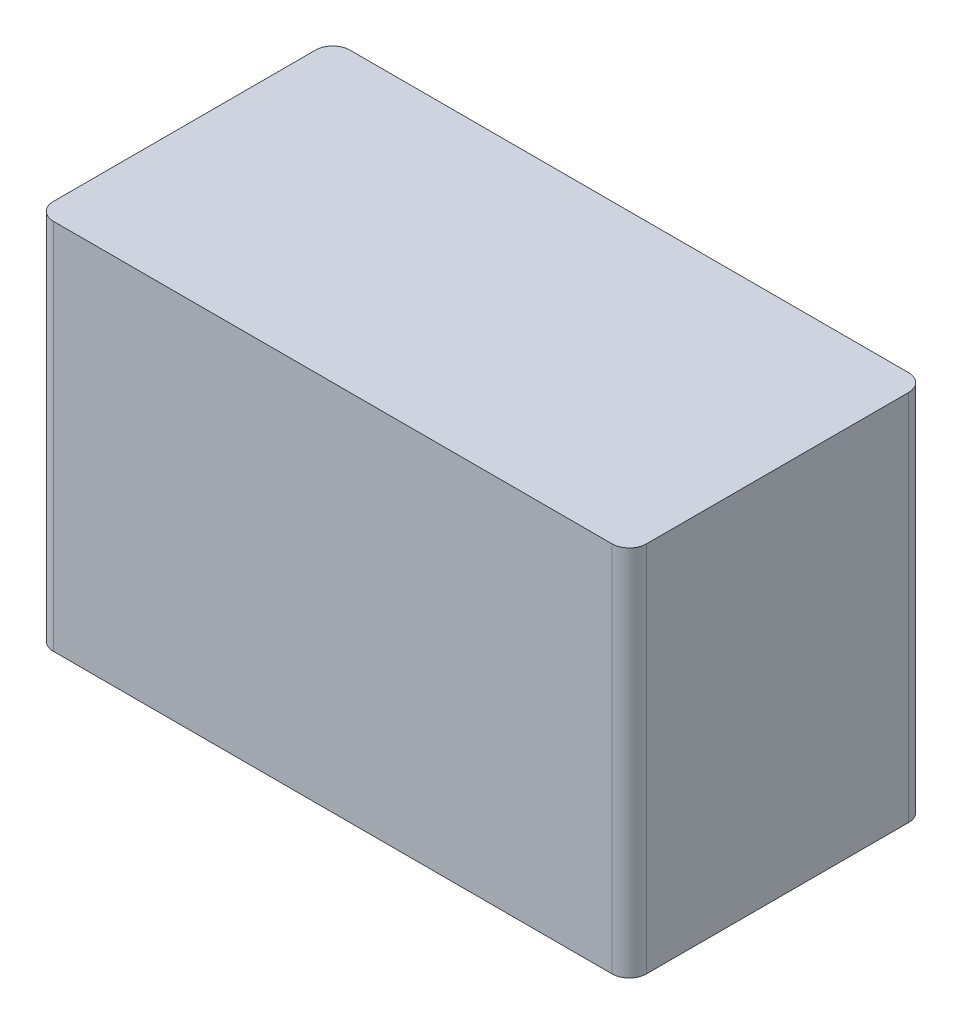
ISO-10303-21;
HEADER;
FILE_DESCRIPTION(('STEP AP214'),'2;1');
FILE_NAME('part.step','',(''),(''),'','','');
FILE_SCHEMA(('AUTOMOTIVE_DESIGN { 1 0 10303 214 1 1 1 1 }'));
ENDSEC;
DATA;
#1=APPLICATION_CONTEXT('core data for automotive mechanical design processes');
#2=APPLICATION_PROTOCOL_DEFINITION('international standard','automotive_design',2000,#1);
#3=PRODUCT_CONTEXT('',#1,'mechanical');
#4=PRODUCT('Part','Part','',(#3));
#5=PRODUCT_RELATED_PRODUCT_CATEGORY('part','',(#4));
#6=PRODUCT_DEFINITION_FORMATION('','',#4);
#7=PRODUCT_DEFINITION_CONTEXT('part definition',#1,'design');
#8=PRODUCT_DEFINITION('design','',#6,#7);
#9=PRODUCT_DEFINITION_SHAPE('','',#8);
#10=(LENGTH_UNIT() NAMED_UNIT(*) SI_UNIT(.MILLI.,.METRE.));
#11=(NAMED_UNIT(*) PLANE_ANGLE_UNIT() SI_UNIT($,.RADIAN.));
#12=(NAMED_UNIT(*) SI_UNIT($,.STERADIAN.) SOLID_ANGLE_UNIT());
#13=UNCERTAINTY_MEASURE_WITH_UNIT(LENGTH_MEASURE(1.E-05),#10,'distance_accuracy_value','');
#14=(GEOMETRIC_REPRESENTATION_CONTEXT(3) GLOBAL_UNCERTAINTY_ASSIGNED_CONTEXT((#13)) GLOBAL_UNIT_ASSIGNED_CONTEXT((#10,
#11,#12)) REPRESENTATION_CONTEXT('',''));
#15=CARTESIAN_POINT('',(0.,0.,0.));
#16=DIRECTION('',(0.,0.,1.));
#17=DIRECTION('',(1.,0.,0.));
#18=AXIS2_PLACEMENT_3D('',#15,#16,#17);
#19=CARTESIAN_POINT('',(20.7,26.,10.35));
#20=DIRECTION('',(-1.,0.,0.));
#21=DIRECTION('',(0.,0.,1.));
#22=AXIS2_PLACEMENT_3D('',#19,#20,#21);
#23=PLANE('',#22);
#24=DIRECTION('',(0.,0.,-1.));
#25=VECTOR('',#24,1.);
#26=CARTESIAN_POINT('',(20.7,0.,10.35));
#27=LINE('',#26,#25);
#28=CARTESIAN_POINT('',(20.7,0.,9.15));
#29=VERTEX_POINT('',#28);
#30=CARTESIAN_POINT('',(20.7,0.,-9.15));
#31=VERTEX_POINT('',#30);
#32=EDGE_CURVE('E126',#29,#31,#27,.T.);
#33=ORIENTED_EDGE('',*,*,#32,.T.);
#34=DIRECTION('',(0.,-1.,0.));
#35=VECTOR('',#34,1.);
#36=CARTESIAN_POINT('',(20.7,26.,-9.15));
#37=LINE('',#36,#35);
#38=CARTESIAN_POINT('',(20.7,26.,-9.15));
#39=VERTEX_POINT('',#38);
#40=EDGE_CURVE('E104',#31,#39,#37,.F.);
#41=ORIENTED_EDGE('',*,*,#40,.T.);
#42=DIRECTION('',(0.,0.,-1.));
#43=VECTOR('',#42,1.);
#44=CARTESIAN_POINT('',(20.7,26.,10.35));
#45=LINE('',#44,#43);
#46=CARTESIAN_POINT('',(20.7,26.,9.15));
#47=VERTEX_POINT('',#46);
#48=EDGE_CURVE('E136',#47,#39,#45,.T.);
#49=ORIENTED_EDGE('',*,*,#48,.F.);
#50=DIRECTION('',(0.,-1.,0.));
#51=VECTOR('',#50,1.);
#52=CARTESIAN_POINT('',(20.7,26.,9.15));
#53=LINE('',#52,#51);
#54=EDGE_CURVE('E109',#47,#29,#53,.T.);
#55=ORIENTED_EDGE('',*,*,#54,.T.);
#56=EDGE_LOOP('',(#33,#41,#49,#55));
#57=FACE_BOUND('',#56,.T.);
#58=ADVANCED_FACE('F34',(#57),#23,.F.);
#59=CARTESIAN_POINT('',(-20.7,26.,-10.35));
#60=DIRECTION('',(0.,0.,1.));
#61=DIRECTION('',(1.,0.,0.));
#62=AXIS2_PLACEMENT_3D('',#59,#60,#61);
#63=PLANE('',#62);
#64=DIRECTION('',(-1.,0.,0.));
#65=VECTOR('',#64,1.);
#66=CARTESIAN_POINT('',(-20.7,26.,-10.35));
#67=LINE('',#66,#65);
#68=CARTESIAN_POINT('',(19.5,26.,-10.35));
#69=VERTEX_POINT('',#68);
#70=CARTESIAN_POINT('',(-19.5,26.,-10.35));
#71=VERTEX_POINT('',#70);
#72=EDGE_CURVE('E119',#69,#71,#67,.T.);
#73=ORIENTED_EDGE('',*,*,#72,.F.);
#74=DIRECTION('',(0.,-1.,0.));
#75=VECTOR('',#74,1.);
#76=CARTESIAN_POINT('',(19.5,26.,-10.35));
#77=LINE('',#76,#75);
#78=CARTESIAN_POINT('',(19.5,0.,-10.35));
#79=VERTEX_POINT('',#78);
#80=EDGE_CURVE('E103',#69,#79,#77,.T.);
#81=ORIENTED_EDGE('',*,*,#80,.T.);
#82=DIRECTION('',(-1.,0.,0.));
#83=VECTOR('',#82,1.);
#84=CARTESIAN_POINT('',(-20.7,0.,-10.35));
#85=LINE('',#84,#83);
#86=CARTESIAN_POINT('',(-19.5,0.,-10.35));
#87=VERTEX_POINT('',#86);
#88=EDGE_CURVE('E116',#79,#87,#85,.T.);
#89=ORIENTED_EDGE('',*,*,#88,.T.);
#90=DIRECTION('',(0.,-1.,0.));
#91=VECTOR('',#90,1.);
#92=CARTESIAN_POINT('',(-19.5,26.,-10.35));
#93=LINE('',#92,#91);
#94=EDGE_CURVE('E121',#87,#71,#93,.F.);
#95=ORIENTED_EDGE('',*,*,#94,.T.);
#96=EDGE_LOOP('',(#73,#81,#89,#95));
#97=FACE_BOUND('',#96,.T.);
#98=ADVANCED_FACE('F115',(#97),#63,.F.);
#99=CARTESIAN_POINT('',(-20.7,26.,10.35));
#100=DIRECTION('',(1.,0.,0.));
#101=DIRECTION('',(0.,0.,-1.));
#102=AXIS2_PLACEMENT_3D('',#99,#100,#101);
#103=PLANE('',#102);
#104=CARTESIAN_POINT('',(-20.7,10.,0.));
#105=DIRECTION('',(1.,0.,0.));
#106=DIRECTION('',(0.,0.,-1.));
#107=AXIS2_PLACEMENT_3D('',#104,#105,#106);
#108=CIRCLE('',#107,5.65);
#109=CARTESIAN_POINT('',(-20.7,10.,-5.65));
#110=VERTEX_POINT('',#109);
#111=EDGE_CURVE('E144',#110,#110,#108,.T.);
#112=ORIENTED_EDGE('',*,*,#111,.T.);
#113=EDGE_LOOP('',(#112));
#114=FACE_BOUND('',#113,.T.);
#115=DIRECTION('',(0.,0.,1.));
#116=VECTOR('',#115,1.);
#117=CARTESIAN_POINT('',(-20.7,26.,10.35));
#118=LINE('',#117,#116);
#119=CARTESIAN_POINT('',(-20.7,26.,-9.15));
#120=VERTEX_POINT('',#119);
#121=CARTESIAN_POINT('',(-20.7,26.,9.15));
#122=VERTEX_POINT('',#121);
#123=EDGE_CURVE('E182',#120,#122,#118,.T.);
#124=ORIENTED_EDGE('',*,*,#123,.F.);
#125=DIRECTION('',(0.,-1.,0.));
#126=VECTOR('',#125,1.);
#127=CARTESIAN_POINT('',(-20.7,26.,-9.15));
#128=LINE('',#127,#126);
#129=CARTESIAN_POINT('',(-20.7,0.,-9.15));
#130=VERTEX_POINT('',#129);
#131=EDGE_CURVE('E167',#120,#130,#128,.T.);
#132=ORIENTED_EDGE('',*,*,#131,.T.);
#133=DIRECTION('',(0.,0.,1.));
#134=VECTOR('',#133,1.);
#135=CARTESIAN_POINT('',(-20.7,0.,10.35));
#136=LINE('',#135,#134);
#137=CARTESIAN_POINT('',(-20.7,0.,9.15));
#138=VERTEX_POINT('',#137);
#139=EDGE_CURVE('E125',#130,#138,#136,.T.);
#140=ORIENTED_EDGE('',*,*,#139,.T.);
#141=DIRECTION('',(0.,-1.,0.));
#142=VECTOR('',#141,1.);
#143=CARTESIAN_POINT('',(-20.7,26.,9.15));
#144=LINE('',#143,#142);
#145=EDGE_CURVE('E165',#138,#122,#144,.F.);
#146=ORIENTED_EDGE('',*,*,#145,.T.);
#147=EDGE_LOOP('',(#124,#132,#140,#146));
#148=FACE_BOUND('',#147,.T.);
#149=ADVANCED_FACE('F197',(#114,#148),#103,.F.);
#150=CARTESIAN_POINT('',(-20.7,26.,10.35));
#151=DIRECTION('',(0.,0.,-1.));
#152=DIRECTION('',(-1.,0.,0.));
#153=AXIS2_PLACEMENT_3D('',#150,#151,#152);
#154=PLANE('',#153);
#155=DIRECTION('',(1.,0.,0.));
#156=VECTOR('',#155,1.);
#157=CARTESIAN_POINT('',(-20.7,0.,10.35));
#158=LINE('',#157,#156);
#159=CARTESIAN_POINT('',(-19.5,0.,10.35));
#160=VERTEX_POINT('',#159);
#161=CARTESIAN_POINT('',(19.5,0.,10.35));
#162=VERTEX_POINT('',#161);
#163=EDGE_CURVE('E129',#160,#162,#158,.T.);
#164=ORIENTED_EDGE('',*,*,#163,.T.);
#165=DIRECTION('',(0.,-1.,0.));
#166=VECTOR('',#165,1.);
#167=CARTESIAN_POINT('',(19.5,26.,10.35));
#168=LINE('',#167,#166);
#169=CARTESIAN_POINT('',(19.5,26.,10.35));
#170=VERTEX_POINT('',#169);
#171=EDGE_CURVE('E11',#162,#170,#168,.F.);
#172=ORIENTED_EDGE('',*,*,#171,.T.);
#173=DIRECTION('',(1.,0.,0.));
#174=VECTOR('',#173,1.);
#175=CARTESIAN_POINT('',(-20.7,26.,10.35));
#176=LINE('',#175,#174);
#177=CARTESIAN_POINT('',(-19.5,26.,10.35));
#178=VERTEX_POINT('',#177);
#179=EDGE_CURVE('E141',#178,#170,#176,.T.);
#180=ORIENTED_EDGE('',*,*,#179,.F.);
#181=DIRECTION('',(0.,-1.,0.));
#182=VECTOR('',#181,1.);
#183=CARTESIAN_POINT('',(-19.5,26.,10.35));
#184=LINE('',#183,#182);
#185=EDGE_CURVE('E42',#178,#160,#184,.T.);
#186=ORIENTED_EDGE('',*,*,#185,.T.);
#187=EDGE_LOOP('',(#164,#172,#180,#186));
#188=FACE_BOUND('',#187,.T.);
#189=ADVANCED_FACE('F172',(#188),#154,.F.);
#190=CARTESIAN_POINT('',(0.,26.,0.));
#191=DIRECTION('',(0.,-1.,0.));
#192=DIRECTION('',(0.,0.,-1.));
#193=AXIS2_PLACEMENT_3D('',#190,#191,#192);
#194=PLANE('',#193);
#195=ORIENTED_EDGE('',*,*,#48,.T.);
#196=CARTESIAN_POINT('',(19.5,26.,-9.15));
#197=DIRECTION('',(0.,-1.,0.));
#198=DIRECTION('',(0.,0.,-1.));
#199=AXIS2_PLACEMENT_3D('',#196,#197,#198);
#200=CIRCLE('',#199,1.2);
#201=EDGE_CURVE('E163',#39,#69,#200,.F.);
#202=ORIENTED_EDGE('',*,*,#201,.T.);
#203=ORIENTED_EDGE('',*,*,#72,.T.);
#204=CARTESIAN_POINT('',(-19.5,26.,-9.15));
#205=DIRECTION('',(0.,-1.,0.));
#206=DIRECTION('',(0.,0.,-1.));
#207=AXIS2_PLACEMENT_3D('',#204,#205,#206);
#208=CIRCLE('',#207,1.2);
#209=EDGE_CURVE('E161',#71,#120,#208,.F.);
#210=ORIENTED_EDGE('',*,*,#209,.T.);
#211=ORIENTED_EDGE('',*,*,#123,.T.);
#212=CARTESIAN_POINT('',(-19.5,26.,9.15));
#213=DIRECTION('',(0.,-1.,0.));
#214=DIRECTION('',(0.,0.,-1.));
#215=AXIS2_PLACEMENT_3D('',#212,#213,#214);
#216=CIRCLE('',#215,1.2);
#217=EDGE_CURVE('E54',#122,#178,#216,.F.);
#218=ORIENTED_EDGE('',*,*,#217,.T.);
#219=ORIENTED_EDGE('',*,*,#179,.T.);
#220=CARTESIAN_POINT('',(19.5,26.,9.15));
#221=DIRECTION('',(0.,-1.,0.));
#222=DIRECTION('',(0.,0.,-1.));
#223=AXIS2_PLACEMENT_3D('',#220,#221,#222);
#224=CIRCLE('',#223,1.2);
#225=EDGE_CURVE('E159',#170,#47,#224,.F.);
#226=ORIENTED_EDGE('',*,*,#225,.T.);
#227=EDGE_LOOP('',(#195,#202,#203,#210,#211,#218,#219,#226));
#228=FACE_BOUND('',#227,.T.);
#229=ADVANCED_FACE('F188',(#228),#194,.F.);
#230=CARTESIAN_POINT('',(0.,0.,0.));
#231=DIRECTION('',(0.,-1.,0.));
#232=DIRECTION('',(0.,0.,-1.));
#233=AXIS2_PLACEMENT_3D('',#230,#231,#232);
#234=PLANE('',#233);
#235=ORIENTED_EDGE('',*,*,#88,.F.);
#236=CARTESIAN_POINT('',(19.5,0.,-9.15));
#237=DIRECTION('',(0.,-1.,0.));
#238=DIRECTION('',(0.,0.,-1.));
#239=AXIS2_PLACEMENT_3D('',#236,#237,#238);
#240=CIRCLE('',#239,1.2);
#241=EDGE_CURVE('E99',#79,#31,#240,.T.);
#242=ORIENTED_EDGE('',*,*,#241,.T.);
#243=ORIENTED_EDGE('',*,*,#32,.F.);
#244=CARTESIAN_POINT('',(19.5,0.,9.15));
#245=DIRECTION('',(0.,-1.,0.));
#246=DIRECTION('',(0.,0.,-1.));
#247=AXIS2_PLACEMENT_3D('',#244,#245,#246);
#248=CIRCLE('',#247,1.2);
#249=EDGE_CURVE('E152',#29,#162,#248,.T.);
#250=ORIENTED_EDGE('',*,*,#249,.T.);
#251=ORIENTED_EDGE('',*,*,#163,.F.);
#252=CARTESIAN_POINT('',(-19.5,0.,9.15));
#253=DIRECTION('',(0.,-1.,0.));
#254=DIRECTION('',(0.,0.,-1.));
#255=AXIS2_PLACEMENT_3D('',#252,#253,#254);
#256=CIRCLE('',#255,1.2);
#257=EDGE_CURVE('E120',#160,#138,#256,.T.);
#258=ORIENTED_EDGE('',*,*,#257,.T.);
#259=ORIENTED_EDGE('',*,*,#139,.F.);
#260=CARTESIAN_POINT('',(-19.5,0.,-9.15));
#261=DIRECTION('',(0.,-1.,0.));
#262=DIRECTION('',(0.,0.,-1.));
#263=AXIS2_PLACEMENT_3D('',#260,#261,#262);
#264=CIRCLE('',#263,1.2);
#265=EDGE_CURVE('E110',#130,#87,#264,.T.);
#266=ORIENTED_EDGE('',*,*,#265,.T.);
#267=EDGE_LOOP('',(#235,#242,#243,#250,#251,#258,#259,#266));
#268=FACE_BOUND('',#267,.T.);
#269=ADVANCED_FACE('F123',(#268),#234,.T.);
#270=CARTESIAN_POINT('',(-21.7,10.,0.));
#271=DIRECTION('',(1.,0.,0.));
#272=DIRECTION('',(0.,0.,-1.));
#273=AXIS2_PLACEMENT_3D('',#270,#271,#272);
#274=CYLINDRICAL_SURFACE('',#273,5.25);
#275=CARTESIAN_POINT('',(-21.1,10.,0.));
#276=DIRECTION('',(1.,0.,0.));
#277=DIRECTION('',(0.,0.,-1.));
#278=AXIS2_PLACEMENT_3D('',#275,#276,#277);
#279=CIRCLE('',#278,5.25);
#280=CARTESIAN_POINT('',(-21.1,10.,-5.25));
#281=VERTEX_POINT('',#280);
#282=EDGE_CURVE('E140',#281,#281,#279,.F.);
#283=ORIENTED_EDGE('',*,*,#282,.T.);
#284=EDGE_LOOP('',(#283));
#285=FACE_BOUND('',#284,.T.);
#286=CARTESIAN_POINT('',(-21.3,10.,0.));
#287=DIRECTION('',(-1.,0.,0.));
#288=DIRECTION('',(0.,0.,1.));
#289=AXIS2_PLACEMENT_3D('',#286,#287,#288);
#290=CIRCLE('',#289,5.25);
#291=CARTESIAN_POINT('',(-21.3,10.,5.25));
#292=VERTEX_POINT('',#291);
#293=EDGE_CURVE('E137',#292,#292,#290,.F.);
#294=ORIENTED_EDGE('',*,*,#293,.T.);
#295=EDGE_LOOP('',(#294));
#296=FACE_BOUND('',#295,.T.);
#297=ADVANCED_FACE('F195',(#285,#296),#274,.T.);
#298=CARTESIAN_POINT('',(-21.7,10.,0.));
#299=DIRECTION('',(-1.,0.,0.));
#300=DIRECTION('',(0.,0.,1.));
#301=AXIS2_PLACEMENT_3D('',#298,#299,#300);
#302=PLANE('',#301);
#303=CARTESIAN_POINT('',(-21.7,10.,0.));
#304=DIRECTION('',(-1.,0.,0.));
#305=DIRECTION('',(0.,0.,1.));
#306=AXIS2_PLACEMENT_3D('',#303,#304,#305);
#307=CIRCLE('',#306,4.35);
#308=CARTESIAN_POINT('',(-21.7,10.,4.35));
#309=VERTEX_POINT('',#308);
#310=EDGE_CURVE('E185',#309,#309,#307,.T.);
#311=ORIENTED_EDGE('',*,*,#310,.F.);
#312=EDGE_LOOP('',(#311));
#313=FACE_BOUND('',#312,.T.);
#314=CARTESIAN_POINT('',(-21.7,10.,0.));
#315=DIRECTION('',(-1.,0.,0.));
#316=DIRECTION('',(0.,0.,1.));
#317=AXIS2_PLACEMENT_3D('',#314,#315,#316);
#318=CIRCLE('',#317,4.85);
#319=CARTESIAN_POINT('',(-21.7,10.,4.85));
#320=VERTEX_POINT('',#319);
#321=EDGE_CURVE('E147',#320,#320,#318,.T.);
#322=ORIENTED_EDGE('',*,*,#321,.T.);
#323=EDGE_LOOP('',(#322));
#324=FACE_BOUND('',#323,.T.);
#325=ADVANCED_FACE('F212',(#313,#324),#302,.T.);
#326=CARTESIAN_POINT('',(-21.1,10.,0.));
#327=DIRECTION('',(1.,0.,0.));
#328=DIRECTION('',(0.,0.,-1.));
#329=AXIS2_PLACEMENT_3D('',#326,#327,#328);
#330=TOROIDAL_SURFACE('',#329,5.65,0.4);
#331=ORIENTED_EDGE('',*,*,#111,.F.);
#332=EDGE_LOOP('',(#331));
#333=FACE_BOUND('',#332,.T.);
#334=ORIENTED_EDGE('',*,*,#282,.F.);
#335=EDGE_LOOP('',(#334));
#336=FACE_BOUND('',#335,.T.);
#337=ADVANCED_FACE('F208',(#333,#336),#330,.F.);
#338=CARTESIAN_POINT('',(-21.3,10.,0.));
#339=DIRECTION('',(-1.,0.,0.));
#340=DIRECTION('',(0.,0.,1.));
#341=AXIS2_PLACEMENT_3D('',#338,#339,#340);
#342=TOROIDAL_SURFACE('',#341,4.85,0.4);
#343=ORIENTED_EDGE('',*,*,#293,.F.);
#344=EDGE_LOOP('',(#343));
#345=FACE_BOUND('',#344,.T.);
#346=ORIENTED_EDGE('',*,*,#321,.F.);
#347=EDGE_LOOP('',(#346));
#348=FACE_BOUND('',#347,.T.);
#349=ADVANCED_FACE('F211',(#345,#348),#342,.T.);
#350=CARTESIAN_POINT('',(-21.6,10.,0.));
#351=DIRECTION('',(-1.,0.,0.));
#352=DIRECTION('',(0.,0.,1.));
#353=AXIS2_PLACEMENT_3D('',#350,#351,#352);
#354=CYLINDRICAL_SURFACE('',#353,4.35);
#355=CARTESIAN_POINT('',(-21.6,10.,0.));
#356=DIRECTION('',(-1.,0.,0.));
#357=DIRECTION('',(0.,0.,1.));
#358=AXIS2_PLACEMENT_3D('',#355,#356,#357);
#359=CIRCLE('',#358,4.35);
#360=CARTESIAN_POINT('',(-21.6,10.,4.35));
#361=VERTEX_POINT('',#360);
#362=EDGE_CURVE('E131',#361,#361,#359,.T.);
#363=ORIENTED_EDGE('',*,*,#362,.F.);
#364=EDGE_LOOP('',(#363));
#365=FACE_BOUND('',#364,.T.);
#366=ORIENTED_EDGE('',*,*,#310,.T.);
#367=EDGE_LOOP('',(#366));
#368=FACE_BOUND('',#367,.T.);
#369=ADVANCED_FACE('F216',(#365,#368),#354,.F.);
#370=CARTESIAN_POINT('',(-21.6,10.,0.));
#371=DIRECTION('',(-1.,0.,0.));
#372=DIRECTION('',(0.,0.,1.));
#373=AXIS2_PLACEMENT_3D('',#370,#371,#372);
#374=PLANE('',#373);
#375=ORIENTED_EDGE('',*,*,#362,.T.);
#376=EDGE_LOOP('',(#375));
#377=FACE_BOUND('',#376,.T.);
#378=ADVANCED_FACE('F221',(#377),#374,.T.);
#379=CARTESIAN_POINT('',(19.5,26.,-9.15));
#380=DIRECTION('',(0.,-1.,0.));
#381=DIRECTION('',(0.,0.,-1.));
#382=AXIS2_PLACEMENT_3D('',#379,#380,#381);
#383=CYLINDRICAL_SURFACE('',#382,1.2);
#384=ORIENTED_EDGE('',*,*,#201,.F.);
#385=ORIENTED_EDGE('',*,*,#40,.F.);
#386=ORIENTED_EDGE('',*,*,#241,.F.);
#387=ORIENTED_EDGE('',*,*,#80,.F.);
#388=EDGE_LOOP('',(#384,#385,#386,#387));
#389=FACE_BOUND('',#388,.T.);
#390=ADVANCED_FACE('F102',(#389),#383,.T.);
#391=CARTESIAN_POINT('',(-19.5,26.,-9.15));
#392=DIRECTION('',(0.,-1.,0.));
#393=DIRECTION('',(0.,0.,-1.));
#394=AXIS2_PLACEMENT_3D('',#391,#392,#393);
#395=CYLINDRICAL_SURFACE('',#394,1.2);
#396=ORIENTED_EDGE('',*,*,#209,.F.);
#397=ORIENTED_EDGE('',*,*,#94,.F.);
#398=ORIENTED_EDGE('',*,*,#265,.F.);
#399=ORIENTED_EDGE('',*,*,#131,.F.);
#400=EDGE_LOOP('',(#396,#397,#398,#399));
#401=FACE_BOUND('',#400,.T.);
#402=ADVANCED_FACE('F220',(#401),#395,.T.);
#403=CARTESIAN_POINT('',(19.5,26.,9.15));
#404=DIRECTION('',(0.,-1.,0.));
#405=DIRECTION('',(0.,0.,-1.));
#406=AXIS2_PLACEMENT_3D('',#403,#404,#405);
#407=CYLINDRICAL_SURFACE('',#406,1.2);
#408=ORIENTED_EDGE('',*,*,#225,.F.);
#409=ORIENTED_EDGE('',*,*,#171,.F.);
#410=ORIENTED_EDGE('',*,*,#249,.F.);
#411=ORIENTED_EDGE('',*,*,#54,.F.);
#412=EDGE_LOOP('',(#408,#409,#410,#411));
#413=FACE_BOUND('',#412,.T.);
#414=ADVANCED_FACE('F177',(#413),#407,.T.);
#415=CARTESIAN_POINT('',(-19.5,26.,9.15));
#416=DIRECTION('',(0.,-1.,0.));
#417=DIRECTION('',(0.,0.,-1.));
#418=AXIS2_PLACEMENT_3D('',#415,#416,#417);
#419=CYLINDRICAL_SURFACE('',#418,1.2);
#420=ORIENTED_EDGE('',*,*,#217,.F.);
#421=ORIENTED_EDGE('',*,*,#145,.F.);
#422=ORIENTED_EDGE('',*,*,#257,.F.);
#423=ORIENTED_EDGE('',*,*,#185,.F.);
#424=EDGE_LOOP('',(#420,#421,#422,#423));
#425=FACE_BOUND('',#424,.T.);
#426=ADVANCED_FACE('F36',(#425),#419,.T.);
#427=CLOSED_SHELL('',(#58,#98,#149,#189,#229,#269,#297,#325,#337,#349,#369,#378,#390,#402,#414,#426));
#428=MANIFOLD_SOLID_BREP('B2',#427);
#429=ADVANCED_BREP_SHAPE_REPRESENTATION('',(#18,#428),#14);
#430=SHAPE_DEFINITION_REPRESENTATION(#9,#429);
ENDSEC;
END-ISO-10303-21;
